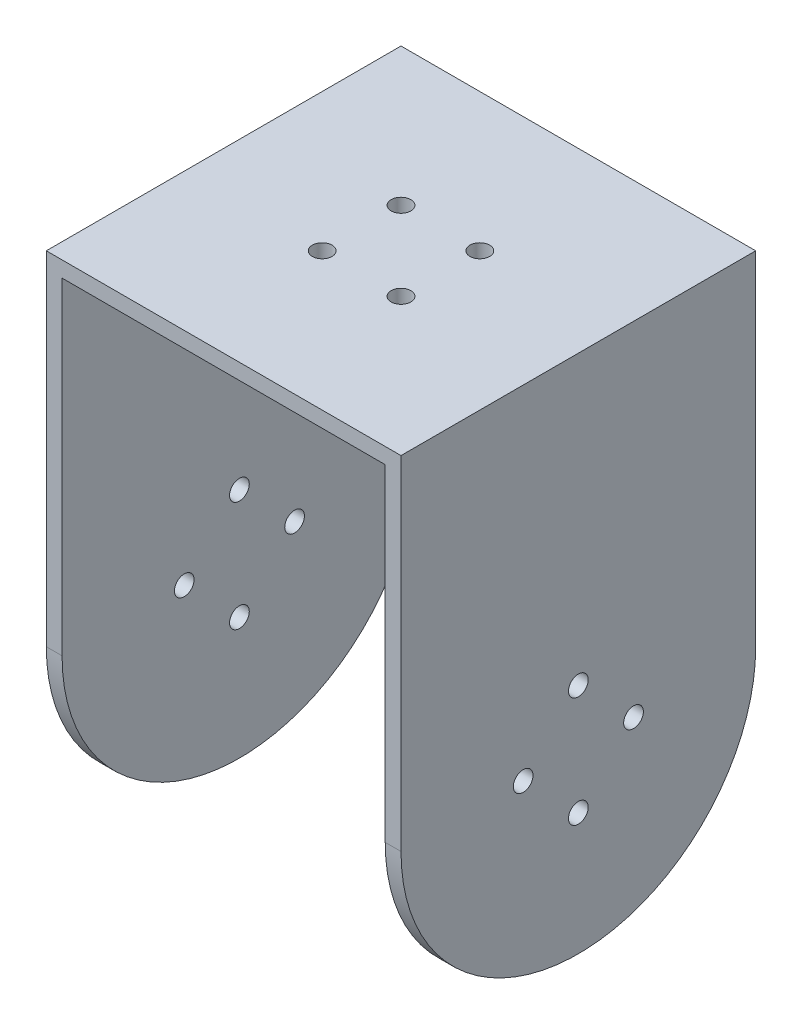
ISO-10303-21;
HEADER;
FILE_DESCRIPTION(('STEP AP214'),'2;1');
FILE_NAME('part.step','',(''),(''),'','','');
FILE_SCHEMA(('AUTOMOTIVE_DESIGN { 1 0 10303 214 1 1 1 1 }'));
ENDSEC;
DATA;
#1=APPLICATION_CONTEXT('core data for automotive mechanical design processes');
#2=APPLICATION_PROTOCOL_DEFINITION('international standard','automotive_design',2000,#1);
#3=PRODUCT_CONTEXT('',#1,'mechanical');
#4=PRODUCT('Part','Part','',(#3));
#5=PRODUCT_RELATED_PRODUCT_CATEGORY('part','',(#4));
#6=PRODUCT_DEFINITION_FORMATION('','',#4);
#7=PRODUCT_DEFINITION_CONTEXT('part definition',#1,'design');
#8=PRODUCT_DEFINITION('design','',#6,#7);
#9=PRODUCT_DEFINITION_SHAPE('','',#8);
#10=(LENGTH_UNIT() NAMED_UNIT(*) SI_UNIT(.MILLI.,.METRE.));
#11=(NAMED_UNIT(*) PLANE_ANGLE_UNIT() SI_UNIT($,.RADIAN.));
#12=(NAMED_UNIT(*) SI_UNIT($,.STERADIAN.) SOLID_ANGLE_UNIT());
#13=UNCERTAINTY_MEASURE_WITH_UNIT(LENGTH_MEASURE(1.E-05),#10,'distance_accuracy_value','');
#14=(GEOMETRIC_REPRESENTATION_CONTEXT(3) GLOBAL_UNCERTAINTY_ASSIGNED_CONTEXT((#13)) GLOBAL_UNIT_ASSIGNED_CONTEXT((#10,
#11,#12)) REPRESENTATION_CONTEXT('',''));
#15=CARTESIAN_POINT('',(0.,0.,0.));
#16=DIRECTION('',(0.,0.,1.));
#17=DIRECTION('',(1.,0.,0.));
#18=AXIS2_PLACEMENT_3D('',#15,#16,#17);
#19=CARTESIAN_POINT('',(-22.5,0.,0.));
#20=DIRECTION('',(1.,0.,0.));
#21=DIRECTION('',(0.,0.,-1.));
#22=AXIS2_PLACEMENT_3D('',#19,#20,#21);
#23=CYLINDRICAL_SURFACE('',#22,22.5);
#24=DIRECTION('',(1.,0.,0.));
#25=VECTOR('',#24,1.);
#26=CARTESIAN_POINT('',(-22.5,0.,22.5));
#27=LINE('',#26,#25);
#28=CARTESIAN_POINT('',(20.5,0.,22.5));
#29=VERTEX_POINT('',#28);
#30=CARTESIAN_POINT('',(22.5,0.,22.5));
#31=VERTEX_POINT('',#30);
#32=EDGE_CURVE('E42',#29,#31,#27,.T.);
#33=ORIENTED_EDGE('',*,*,#32,.F.);
#34=CARTESIAN_POINT('',(20.5,0.,0.));
#35=DIRECTION('',(-1.,0.,0.));
#36=DIRECTION('',(0.,0.,1.));
#37=AXIS2_PLACEMENT_3D('',#34,#35,#36);
#38=CIRCLE('',#37,22.5);
#39=CARTESIAN_POINT('',(20.5,0.,-22.5));
#40=VERTEX_POINT('',#39);
#41=EDGE_CURVE('E122',#29,#40,#38,.F.);
#42=ORIENTED_EDGE('',*,*,#41,.T.);
#43=DIRECTION('',(1.,0.,0.));
#44=VECTOR('',#43,1.);
#45=CARTESIAN_POINT('',(-22.5,0.,-22.5));
#46=LINE('',#45,#44);
#47=CARTESIAN_POINT('',(22.5,0.,-22.5));
#48=VERTEX_POINT('',#47);
#49=EDGE_CURVE('E118',#40,#48,#46,.T.);
#50=ORIENTED_EDGE('',*,*,#49,.T.);
#51=CARTESIAN_POINT('',(22.5,0.,0.));
#52=DIRECTION('',(1.,0.,0.));
#53=DIRECTION('',(0.,0.,1.));
#54=AXIS2_PLACEMENT_3D('',#51,#52,#53);
#55=CIRCLE('',#54,22.5);
#56=EDGE_CURVE('E129',#31,#48,#55,.T.);
#57=ORIENTED_EDGE('',*,*,#56,.F.);
#58=EDGE_LOOP('',(#33,#42,#50,#57));
#59=FACE_BOUND('',#58,.T.);
#60=ADVANCED_FACE('F34',(#59),#23,.T.);
#61=CARTESIAN_POINT('',(-22.5,0.,-22.5));
#62=VERTEX_POINT('',#61);
#63=CARTESIAN_POINT('',(-20.5,0.,-22.5));
#64=VERTEX_POINT('',#63);
#65=EDGE_CURVE('E156',#62,#64,#46,.T.);
#66=ORIENTED_EDGE('',*,*,#65,.T.);
#67=CARTESIAN_POINT('',(-20.5,0.,0.));
#68=DIRECTION('',(1.,0.,0.));
#69=DIRECTION('',(0.,0.,-1.));
#70=AXIS2_PLACEMENT_3D('',#67,#68,#69);
#71=CIRCLE('',#70,22.5);
#72=CARTESIAN_POINT('',(-20.5,0.,22.5));
#73=VERTEX_POINT('',#72);
#74=EDGE_CURVE('E119',#64,#73,#71,.F.);
#75=ORIENTED_EDGE('',*,*,#74,.T.);
#76=CARTESIAN_POINT('',(-22.5,0.,22.5));
#77=VERTEX_POINT('',#76);
#78=EDGE_CURVE('E11',#77,#73,#27,.T.);
#79=ORIENTED_EDGE('',*,*,#78,.F.);
#80=CARTESIAN_POINT('',(-22.5,0.,0.));
#81=DIRECTION('',(1.,0.,0.));
#82=DIRECTION('',(0.,0.,1.));
#83=AXIS2_PLACEMENT_3D('',#80,#81,#82);
#84=CIRCLE('',#83,22.5);
#85=EDGE_CURVE('E141',#77,#62,#84,.T.);
#86=ORIENTED_EDGE('',*,*,#85,.T.);
#87=EDGE_LOOP('',(#66,#75,#79,#86));
#88=FACE_BOUND('',#87,.T.);
#89=ADVANCED_FACE('F231',(#88),#23,.T.);
#90=CARTESIAN_POINT('',(-22.5,0.,22.5));
#91=DIRECTION('',(0.,0.,1.));
#92=DIRECTION('',(1.,0.,0.));
#93=AXIS2_PLACEMENT_3D('',#90,#91,#92);
#94=PLANE('',#93);
#95=DIRECTION('',(1.,0.,0.));
#96=VECTOR('',#95,1.);
#97=CARTESIAN_POINT('',(-20.5,41.5,22.5));
#98=LINE('',#97,#96);
#99=CARTESIAN_POINT('',(-20.5,41.5,22.5));
#100=VERTEX_POINT('',#99);
#101=CARTESIAN_POINT('',(20.5,41.5,22.5));
#102=VERTEX_POINT('',#101);
#103=EDGE_CURVE('E217',#100,#102,#98,.T.);
#104=ORIENTED_EDGE('',*,*,#103,.T.);
#105=DIRECTION('',(0.,-1.,0.));
#106=VECTOR('',#105,1.);
#107=CARTESIAN_POINT('',(20.5,41.5,22.5));
#108=LINE('',#107,#106);
#109=EDGE_CURVE('E113',#102,#29,#108,.T.);
#110=ORIENTED_EDGE('',*,*,#109,.T.);
#111=ORIENTED_EDGE('',*,*,#32,.T.);
#112=DIRECTION('',(0.,-1.,0.));
#113=VECTOR('',#112,1.);
#114=CARTESIAN_POINT('',(22.5,0.,22.5));
#115=LINE('',#114,#113);
#116=CARTESIAN_POINT('',(22.5,43.5,22.5));
#117=VERTEX_POINT('',#116);
#118=EDGE_CURVE('E138',#117,#31,#115,.T.);
#119=ORIENTED_EDGE('',*,*,#118,.F.);
#120=DIRECTION('',(1.,0.,0.));
#121=VECTOR('',#120,1.);
#122=CARTESIAN_POINT('',(-22.5,43.5,22.5));
#123=LINE('',#122,#121);
#124=CARTESIAN_POINT('',(-22.5,43.5,22.5));
#125=VERTEX_POINT('',#124);
#126=EDGE_CURVE('E152',#125,#117,#123,.T.);
#127=ORIENTED_EDGE('',*,*,#126,.F.);
#128=DIRECTION('',(0.,-1.,0.));
#129=VECTOR('',#128,1.);
#130=CARTESIAN_POINT('',(-22.5,0.,22.5));
#131=LINE('',#130,#129);
#132=EDGE_CURVE('E149',#125,#77,#131,.T.);
#133=ORIENTED_EDGE('',*,*,#132,.T.);
#134=ORIENTED_EDGE('',*,*,#78,.T.);
#135=DIRECTION('',(0.,-1.,0.));
#136=VECTOR('',#135,1.);
#137=CARTESIAN_POINT('',(-20.5,41.5,22.5));
#138=LINE('',#137,#136);
#139=EDGE_CURVE('E124',#100,#73,#138,.T.);
#140=ORIENTED_EDGE('',*,*,#139,.F.);
#141=EDGE_LOOP('',(#104,#110,#111,#119,#127,#133,#134,#140));
#142=FACE_BOUND('',#141,.T.);
#143=ADVANCED_FACE('F224',(#142),#94,.T.);
#144=CARTESIAN_POINT('',(-22.5,0.,-22.5));
#145=DIRECTION('',(0.,0.,-1.));
#146=DIRECTION('',(-1.,0.,0.));
#147=AXIS2_PLACEMENT_3D('',#144,#145,#146);
#148=PLANE('',#147);
#149=ORIENTED_EDGE('',*,*,#49,.F.);
#150=DIRECTION('',(0.,-1.,0.));
#151=VECTOR('',#150,1.);
#152=CARTESIAN_POINT('',(20.5,41.5,-22.5));
#153=LINE('',#152,#151);
#154=CARTESIAN_POINT('',(20.5,41.5,-22.5));
#155=VERTEX_POINT('',#154);
#156=EDGE_CURVE('E110',#155,#40,#153,.T.);
#157=ORIENTED_EDGE('',*,*,#156,.F.);
#158=DIRECTION('',(-1.,0.,0.));
#159=VECTOR('',#158,1.);
#160=CARTESIAN_POINT('',(-20.5,41.5,-22.5));
#161=LINE('',#160,#159);
#162=CARTESIAN_POINT('',(-20.5,41.5,-22.5));
#163=VERTEX_POINT('',#162);
#164=EDGE_CURVE('E98',#155,#163,#161,.T.);
#165=ORIENTED_EDGE('',*,*,#164,.T.);
#166=DIRECTION('',(0.,-1.,0.));
#167=VECTOR('',#166,1.);
#168=CARTESIAN_POINT('',(-20.5,41.5,-22.5));
#169=LINE('',#168,#167);
#170=EDGE_CURVE('E120',#163,#64,#169,.T.);
#171=ORIENTED_EDGE('',*,*,#170,.T.);
#172=ORIENTED_EDGE('',*,*,#65,.F.);
#173=DIRECTION('',(0.,1.,0.));
#174=VECTOR('',#173,1.);
#175=CARTESIAN_POINT('',(-22.5,0.,-22.5));
#176=LINE('',#175,#174);
#177=CARTESIAN_POINT('',(-22.5,43.5,-22.5));
#178=VERTEX_POINT('',#177);
#179=EDGE_CURVE('E143',#62,#178,#176,.T.);
#180=ORIENTED_EDGE('',*,*,#179,.T.);
#181=DIRECTION('',(1.,0.,0.));
#182=VECTOR('',#181,1.);
#183=CARTESIAN_POINT('',(-22.5,43.5,-22.5));
#184=LINE('',#183,#182);
#185=CARTESIAN_POINT('',(22.5,43.5,-22.5));
#186=VERTEX_POINT('',#185);
#187=EDGE_CURVE('E154',#178,#186,#184,.T.);
#188=ORIENTED_EDGE('',*,*,#187,.T.);
#189=DIRECTION('',(0.,1.,0.));
#190=VECTOR('',#189,1.);
#191=CARTESIAN_POINT('',(22.5,0.,-22.5));
#192=LINE('',#191,#190);
#193=EDGE_CURVE('E132',#48,#186,#192,.T.);
#194=ORIENTED_EDGE('',*,*,#193,.F.);
#195=EDGE_LOOP('',(#149,#157,#165,#171,#172,#180,#188,#194));
#196=FACE_BOUND('',#195,.T.);
#197=ADVANCED_FACE('F116',(#196),#148,.T.);
#198=CARTESIAN_POINT('',(-22.5,43.5,22.5));
#199=DIRECTION('',(0.,1.,0.));
#200=DIRECTION('',(0.,0.,1.));
#201=AXIS2_PLACEMENT_3D('',#198,#199,#200);
#202=PLANE('',#201);
#203=CARTESIAN_POINT('',(-5.,43.5,5.));
#204=DIRECTION('',(0.,1.,0.));
#205=DIRECTION('',(0.,0.,-1.));
#206=AXIS2_PLACEMENT_3D('',#203,#204,#205);
#207=CIRCLE('',#206,1.25);
#208=CARTESIAN_POINT('',(-5.,43.5,3.75));
#209=VERTEX_POINT('',#208);
#210=EDGE_CURVE('E205',#209,#209,#207,.T.);
#211=ORIENTED_EDGE('',*,*,#210,.F.);
#212=EDGE_LOOP('',(#211));
#213=FACE_BOUND('',#212,.T.);
#214=CARTESIAN_POINT('',(5.,43.5,-5.));
#215=DIRECTION('',(0.,1.,0.));
#216=DIRECTION('',(0.,0.,1.));
#217=AXIS2_PLACEMENT_3D('',#214,#215,#216);
#218=CIRCLE('',#217,1.25);
#219=CARTESIAN_POINT('',(5.,43.5,-3.75));
#220=VERTEX_POINT('',#219);
#221=EDGE_CURVE('E209',#220,#220,#218,.T.);
#222=ORIENTED_EDGE('',*,*,#221,.F.);
#223=EDGE_LOOP('',(#222));
#224=FACE_BOUND('',#223,.T.);
#225=CARTESIAN_POINT('',(5.,43.5,5.));
#226=DIRECTION('',(0.,1.,0.));
#227=DIRECTION('',(0.,0.,-1.));
#228=AXIS2_PLACEMENT_3D('',#225,#226,#227);
#229=CIRCLE('',#228,1.25);
#230=CARTESIAN_POINT('',(5.,43.5,3.75));
#231=VERTEX_POINT('',#230);
#232=EDGE_CURVE('E206',#231,#231,#229,.T.);
#233=ORIENTED_EDGE('',*,*,#232,.F.);
#234=EDGE_LOOP('',(#233));
#235=FACE_BOUND('',#234,.T.);
#236=CARTESIAN_POINT('',(-5.,43.5,-5.));
#237=DIRECTION('',(0.,1.,0.));
#238=DIRECTION('',(0.,0.,1.));
#239=AXIS2_PLACEMENT_3D('',#236,#237,#238);
#240=CIRCLE('',#239,1.25);
#241=CARTESIAN_POINT('',(-5.,43.5,-3.75));
#242=VERTEX_POINT('',#241);
#243=EDGE_CURVE('E163',#242,#242,#240,.T.);
#244=ORIENTED_EDGE('',*,*,#243,.F.);
#245=EDGE_LOOP('',(#244));
#246=FACE_BOUND('',#245,.T.);
#247=ORIENTED_EDGE('',*,*,#126,.T.);
#248=DIRECTION('',(0.,0.,1.));
#249=VECTOR('',#248,1.);
#250=CARTESIAN_POINT('',(22.5,43.5,22.5));
#251=LINE('',#250,#249);
#252=EDGE_CURVE('E135',#186,#117,#251,.T.);
#253=ORIENTED_EDGE('',*,*,#252,.F.);
#254=ORIENTED_EDGE('',*,*,#187,.F.);
#255=DIRECTION('',(0.,0.,1.));
#256=VECTOR('',#255,1.);
#257=CARTESIAN_POINT('',(-22.5,43.5,22.5));
#258=LINE('',#257,#256);
#259=EDGE_CURVE('E146',#178,#125,#258,.T.);
#260=ORIENTED_EDGE('',*,*,#259,.T.);
#261=EDGE_LOOP('',(#247,#253,#254,#260));
#262=FACE_BOUND('',#261,.T.);
#263=ADVANCED_FACE('F237',(#213,#224,#235,#246,#262),#202,.T.);
#264=CARTESIAN_POINT('',(-22.5,0.,0.));
#265=DIRECTION('',(-1.,0.,0.));
#266=DIRECTION('',(0.,0.,1.));
#267=AXIS2_PLACEMENT_3D('',#264,#265,#266);
#268=PLANE('',#267);
#269=CARTESIAN_POINT('',(-22.5,0.,0.));
#270=DIRECTION('',(-1.,0.,0.));
#271=DIRECTION('',(0.,0.,1.));
#272=AXIS2_PLACEMENT_3D('',#269,#270,#271);
#273=CIRCLE('',#272,3.18176817692474);
#274=CARTESIAN_POINT('',(-22.5,0.,3.18176817692474));
#275=VERTEX_POINT('',#274);
#276=EDGE_CURVE('E323',#275,#275,#273,.T.);
#277=ORIENTED_EDGE('',*,*,#276,.F.);
#278=EDGE_LOOP('',(#277));
#279=FACE_BOUND('',#278,.T.);
#280=CARTESIAN_POINT('',(-22.5,7.,0.));
#281=DIRECTION('',(-1.,0.,0.));
#282=DIRECTION('',(0.,0.,1.));
#283=AXIS2_PLACEMENT_3D('',#280,#281,#282);
#284=CIRCLE('',#283,1.25);
#285=CARTESIAN_POINT('',(-22.5,7.,1.25));
#286=VERTEX_POINT('',#285);
#287=EDGE_CURVE('E175',#286,#286,#284,.T.);
#288=ORIENTED_EDGE('',*,*,#287,.F.);
#289=EDGE_LOOP('',(#288));
#290=FACE_BOUND('',#289,.T.);
#291=CARTESIAN_POINT('',(-22.5,-7.,0.));
#292=DIRECTION('',(-1.,0.,0.));
#293=DIRECTION('',(0.,0.,-1.));
#294=AXIS2_PLACEMENT_3D('',#291,#292,#293);
#295=CIRCLE('',#294,1.25);
#296=CARTESIAN_POINT('',(-22.5,-7.,-1.25));
#297=VERTEX_POINT('',#296);
#298=EDGE_CURVE('E333',#297,#297,#295,.T.);
#299=ORIENTED_EDGE('',*,*,#298,.F.);
#300=EDGE_LOOP('',(#299));
#301=FACE_BOUND('',#300,.T.);
#302=CARTESIAN_POINT('',(-22.5,0.,-7.));
#303=DIRECTION('',(-1.,0.,0.));
#304=DIRECTION('',(0.,0.,1.));
#305=AXIS2_PLACEMENT_3D('',#302,#303,#304);
#306=CIRCLE('',#305,1.25);
#307=CARTESIAN_POINT('',(-22.5,0.,-5.75));
#308=VERTEX_POINT('',#307);
#309=EDGE_CURVE('E326',#308,#308,#306,.T.);
#310=ORIENTED_EDGE('',*,*,#309,.F.);
#311=EDGE_LOOP('',(#310));
#312=FACE_BOUND('',#311,.T.);
#313=CARTESIAN_POINT('',(-22.5,0.,7.));
#314=DIRECTION('',(-1.,0.,0.));
#315=DIRECTION('',(0.,0.,-1.));
#316=AXIS2_PLACEMENT_3D('',#313,#314,#315);
#317=CIRCLE('',#316,1.25);
#318=CARTESIAN_POINT('',(-22.5,0.,5.75));
#319=VERTEX_POINT('',#318);
#320=EDGE_CURVE('E322',#319,#319,#317,.T.);
#321=ORIENTED_EDGE('',*,*,#320,.F.);
#322=EDGE_LOOP('',(#321));
#323=FACE_BOUND('',#322,.T.);
#324=ORIENTED_EDGE('',*,*,#85,.F.);
#325=ORIENTED_EDGE('',*,*,#132,.F.);
#326=ORIENTED_EDGE('',*,*,#259,.F.);
#327=ORIENTED_EDGE('',*,*,#179,.F.);
#328=EDGE_LOOP('',(#324,#325,#326,#327));
#329=FACE_BOUND('',#328,.T.);
#330=ADVANCED_FACE('F229',(#279,#290,#301,#312,#323,#329),#268,.T.);
#331=CARTESIAN_POINT('',(22.5,0.,0.));
#332=DIRECTION('',(-1.,0.,0.));
#333=DIRECTION('',(0.,0.,1.));
#334=AXIS2_PLACEMENT_3D('',#331,#332,#333);
#335=PLANE('',#334);
#336=CARTESIAN_POINT('',(22.5,7.,0.));
#337=DIRECTION('',(-1.,0.,0.));
#338=DIRECTION('',(0.,0.,1.));
#339=AXIS2_PLACEMENT_3D('',#336,#337,#338);
#340=CIRCLE('',#339,1.25);
#341=CARTESIAN_POINT('',(22.5,7.,1.25));
#342=VERTEX_POINT('',#341);
#343=EDGE_CURVE('E202',#342,#342,#340,.T.);
#344=ORIENTED_EDGE('',*,*,#343,.T.);
#345=EDGE_LOOP('',(#344));
#346=FACE_BOUND('',#345,.T.);
#347=CARTESIAN_POINT('',(22.5,-7.,0.));
#348=DIRECTION('',(-1.,0.,0.));
#349=DIRECTION('',(0.,0.,1.));
#350=AXIS2_PLACEMENT_3D('',#347,#348,#349);
#351=CIRCLE('',#350,1.25);
#352=CARTESIAN_POINT('',(22.5,-7.,1.25));
#353=VERTEX_POINT('',#352);
#354=EDGE_CURVE('E187',#353,#353,#351,.T.);
#355=ORIENTED_EDGE('',*,*,#354,.T.);
#356=EDGE_LOOP('',(#355));
#357=FACE_BOUND('',#356,.T.);
#358=CARTESIAN_POINT('',(22.5,0.,-7.));
#359=DIRECTION('',(-1.,0.,0.));
#360=DIRECTION('',(0.,0.,1.));
#361=AXIS2_PLACEMENT_3D('',#358,#359,#360);
#362=CIRCLE('',#361,1.25);
#363=CARTESIAN_POINT('',(22.5,0.,-5.75));
#364=VERTEX_POINT('',#363);
#365=EDGE_CURVE('E183',#364,#364,#362,.T.);
#366=ORIENTED_EDGE('',*,*,#365,.T.);
#367=EDGE_LOOP('',(#366));
#368=FACE_BOUND('',#367,.T.);
#369=CARTESIAN_POINT('',(22.5,0.,7.));
#370=DIRECTION('',(-1.,0.,0.));
#371=DIRECTION('',(0.,0.,1.));
#372=AXIS2_PLACEMENT_3D('',#369,#370,#371);
#373=CIRCLE('',#372,1.25);
#374=CARTESIAN_POINT('',(22.5,0.,8.25));
#375=VERTEX_POINT('',#374);
#376=EDGE_CURVE('E179',#375,#375,#373,.T.);
#377=ORIENTED_EDGE('',*,*,#376,.T.);
#378=EDGE_LOOP('',(#377));
#379=FACE_BOUND('',#378,.T.);
#380=ORIENTED_EDGE('',*,*,#56,.T.);
#381=ORIENTED_EDGE('',*,*,#193,.T.);
#382=ORIENTED_EDGE('',*,*,#252,.T.);
#383=ORIENTED_EDGE('',*,*,#118,.T.);
#384=EDGE_LOOP('',(#380,#381,#382,#383));
#385=FACE_BOUND('',#384,.T.);
#386=ADVANCED_FACE('F235',(#346,#357,#368,#379,#385),#335,.F.);
#387=CARTESIAN_POINT('',(20.5,41.5,-22.5));
#388=DIRECTION('',(-1.,0.,0.));
#389=DIRECTION('',(0.,0.,1.));
#390=AXIS2_PLACEMENT_3D('',#387,#388,#389);
#391=PLANE('',#390);
#392=CARTESIAN_POINT('',(20.5,7.,0.));
#393=DIRECTION('',(-1.,0.,0.));
#394=DIRECTION('',(0.,0.,1.));
#395=AXIS2_PLACEMENT_3D('',#392,#393,#394);
#396=CIRCLE('',#395,1.25);
#397=CARTESIAN_POINT('',(20.5,7.,1.25));
#398=VERTEX_POINT('',#397);
#399=EDGE_CURVE('E199',#398,#398,#396,.T.);
#400=ORIENTED_EDGE('',*,*,#399,.F.);
#401=EDGE_LOOP('',(#400));
#402=FACE_BOUND('',#401,.T.);
#403=CARTESIAN_POINT('',(20.5,-7.,0.));
#404=DIRECTION('',(-1.,0.,0.));
#405=DIRECTION('',(0.,0.,1.));
#406=AXIS2_PLACEMENT_3D('',#403,#404,#405);
#407=CIRCLE('',#406,1.25);
#408=CARTESIAN_POINT('',(20.5,-7.,1.25));
#409=VERTEX_POINT('',#408);
#410=EDGE_CURVE('E182',#409,#409,#407,.T.);
#411=ORIENTED_EDGE('',*,*,#410,.F.);
#412=EDGE_LOOP('',(#411));
#413=FACE_BOUND('',#412,.T.);
#414=CARTESIAN_POINT('',(20.5,0.,-7.));
#415=DIRECTION('',(-1.,0.,0.));
#416=DIRECTION('',(0.,0.,1.));
#417=AXIS2_PLACEMENT_3D('',#414,#415,#416);
#418=CIRCLE('',#417,1.25);
#419=CARTESIAN_POINT('',(20.5,0.,-5.75));
#420=VERTEX_POINT('',#419);
#421=EDGE_CURVE('E178',#420,#420,#418,.T.);
#422=ORIENTED_EDGE('',*,*,#421,.F.);
#423=EDGE_LOOP('',(#422));
#424=FACE_BOUND('',#423,.T.);
#425=CARTESIAN_POINT('',(20.5,0.,7.));
#426=DIRECTION('',(-1.,0.,0.));
#427=DIRECTION('',(0.,0.,1.));
#428=AXIS2_PLACEMENT_3D('',#425,#426,#427);
#429=CIRCLE('',#428,1.25);
#430=CARTESIAN_POINT('',(20.5,0.,8.25));
#431=VERTEX_POINT('',#430);
#432=EDGE_CURVE('E174',#431,#431,#429,.T.);
#433=ORIENTED_EDGE('',*,*,#432,.F.);
#434=EDGE_LOOP('',(#433));
#435=FACE_BOUND('',#434,.T.);
#436=ORIENTED_EDGE('',*,*,#109,.F.);
#437=DIRECTION('',(0.,0.,-1.));
#438=VECTOR('',#437,1.);
#439=CARTESIAN_POINT('',(20.5,41.5,-22.5));
#440=LINE('',#439,#438);
#441=EDGE_CURVE('E101',#102,#155,#440,.T.);
#442=ORIENTED_EDGE('',*,*,#441,.T.);
#443=ORIENTED_EDGE('',*,*,#156,.T.);
#444=ORIENTED_EDGE('',*,*,#41,.F.);
#445=EDGE_LOOP('',(#436,#442,#443,#444));
#446=FACE_BOUND('',#445,.T.);
#447=ADVANCED_FACE('F109',(#402,#413,#424,#435,#446),#391,.T.);
#448=CARTESIAN_POINT('',(-20.5,41.5,-22.5));
#449=DIRECTION('',(1.,0.,0.));
#450=DIRECTION('',(0.,0.,-1.));
#451=AXIS2_PLACEMENT_3D('',#448,#449,#450);
#452=PLANE('',#451);
#453=CARTESIAN_POINT('',(-20.5,7.,0.));
#454=DIRECTION('',(1.,0.,0.));
#455=DIRECTION('',(0.,0.,-1.));
#456=AXIS2_PLACEMENT_3D('',#453,#454,#455);
#457=CIRCLE('',#456,1.25);
#458=CARTESIAN_POINT('',(-20.5,7.,-1.25));
#459=VERTEX_POINT('',#458);
#460=EDGE_CURVE('E37',#459,#459,#457,.T.);
#461=ORIENTED_EDGE('',*,*,#460,.F.);
#462=EDGE_LOOP('',(#461));
#463=FACE_BOUND('',#462,.T.);
#464=CARTESIAN_POINT('',(-20.5,-7.,0.));
#465=DIRECTION('',(1.,0.,0.));
#466=DIRECTION('',(0.,0.,-1.));
#467=AXIS2_PLACEMENT_3D('',#464,#465,#466);
#468=CIRCLE('',#467,1.25);
#469=CARTESIAN_POINT('',(-20.5,-7.,-1.25));
#470=VERTEX_POINT('',#469);
#471=EDGE_CURVE('E180',#470,#470,#468,.T.);
#472=ORIENTED_EDGE('',*,*,#471,.F.);
#473=EDGE_LOOP('',(#472));
#474=FACE_BOUND('',#473,.T.);
#475=CARTESIAN_POINT('',(-20.5,0.,-7.));
#476=DIRECTION('',(1.,0.,0.));
#477=DIRECTION('',(0.,0.,-1.));
#478=AXIS2_PLACEMENT_3D('',#475,#476,#477);
#479=CIRCLE('',#478,1.25);
#480=CARTESIAN_POINT('',(-20.5,0.,-8.25));
#481=VERTEX_POINT('',#480);
#482=EDGE_CURVE('E176',#481,#481,#479,.T.);
#483=ORIENTED_EDGE('',*,*,#482,.F.);
#484=EDGE_LOOP('',(#483));
#485=FACE_BOUND('',#484,.T.);
#486=CARTESIAN_POINT('',(-20.5,0.,7.));
#487=DIRECTION('',(1.,0.,0.));
#488=DIRECTION('',(0.,0.,-1.));
#489=AXIS2_PLACEMENT_3D('',#486,#487,#488);
#490=CIRCLE('',#489,1.25);
#491=CARTESIAN_POINT('',(-20.5,0.,5.75));
#492=VERTEX_POINT('',#491);
#493=EDGE_CURVE('E171',#492,#492,#490,.T.);
#494=ORIENTED_EDGE('',*,*,#493,.F.);
#495=EDGE_LOOP('',(#494));
#496=FACE_BOUND('',#495,.T.);
#497=ORIENTED_EDGE('',*,*,#170,.F.);
#498=DIRECTION('',(0.,0.,1.));
#499=VECTOR('',#498,1.);
#500=CARTESIAN_POINT('',(-20.5,41.5,-22.5));
#501=LINE('',#500,#499);
#502=EDGE_CURVE('E50',#163,#100,#501,.T.);
#503=ORIENTED_EDGE('',*,*,#502,.T.);
#504=ORIENTED_EDGE('',*,*,#139,.T.);
#505=ORIENTED_EDGE('',*,*,#74,.F.);
#506=EDGE_LOOP('',(#497,#503,#504,#505));
#507=FACE_BOUND('',#506,.T.);
#508=ADVANCED_FACE('F222',(#463,#474,#485,#496,#507),#452,.T.);
#509=CARTESIAN_POINT('',(0.,41.5,0.));
#510=DIRECTION('',(0.,1.,0.));
#511=DIRECTION('',(0.,0.,1.));
#512=AXIS2_PLACEMENT_3D('',#509,#510,#511);
#513=PLANE('',#512);
#514=CARTESIAN_POINT('',(-5.,41.5,5.));
#515=DIRECTION('',(0.,1.,0.));
#516=DIRECTION('',(0.,0.,1.));
#517=AXIS2_PLACEMENT_3D('',#514,#515,#516);
#518=CIRCLE('',#517,1.25);
#519=CARTESIAN_POINT('',(-5.,41.5,6.25));
#520=VERTEX_POINT('',#519);
#521=EDGE_CURVE('E114',#520,#520,#518,.T.);
#522=ORIENTED_EDGE('',*,*,#521,.T.);
#523=EDGE_LOOP('',(#522));
#524=FACE_BOUND('',#523,.T.);
#525=CARTESIAN_POINT('',(5.,41.5,-5.));
#526=DIRECTION('',(0.,1.,0.));
#527=DIRECTION('',(0.,0.,1.));
#528=AXIS2_PLACEMENT_3D('',#525,#526,#527);
#529=CIRCLE('',#528,1.25);
#530=CARTESIAN_POINT('',(5.,41.5,-3.75));
#531=VERTEX_POINT('',#530);
#532=EDGE_CURVE('E166',#531,#531,#529,.T.);
#533=ORIENTED_EDGE('',*,*,#532,.T.);
#534=EDGE_LOOP('',(#533));
#535=FACE_BOUND('',#534,.T.);
#536=CARTESIAN_POINT('',(5.,41.5,5.));
#537=DIRECTION('',(0.,1.,0.));
#538=DIRECTION('',(0.,0.,1.));
#539=AXIS2_PLACEMENT_3D('',#536,#537,#538);
#540=CIRCLE('',#539,1.25);
#541=CARTESIAN_POINT('',(5.,41.5,6.25));
#542=VERTEX_POINT('',#541);
#543=EDGE_CURVE('E162',#542,#542,#540,.T.);
#544=ORIENTED_EDGE('',*,*,#543,.T.);
#545=EDGE_LOOP('',(#544));
#546=FACE_BOUND('',#545,.T.);
#547=CARTESIAN_POINT('',(-5.,41.5,-5.));
#548=DIRECTION('',(0.,1.,0.));
#549=DIRECTION('',(0.,0.,1.));
#550=AXIS2_PLACEMENT_3D('',#547,#548,#549);
#551=CIRCLE('',#550,1.25);
#552=CARTESIAN_POINT('',(-5.,41.5,-3.75));
#553=VERTEX_POINT('',#552);
#554=EDGE_CURVE('E159',#553,#553,#551,.T.);
#555=ORIENTED_EDGE('',*,*,#554,.T.);
#556=EDGE_LOOP('',(#555));
#557=FACE_BOUND('',#556,.T.);
#558=ORIENTED_EDGE('',*,*,#441,.F.);
#559=ORIENTED_EDGE('',*,*,#103,.F.);
#560=ORIENTED_EDGE('',*,*,#502,.F.);
#561=ORIENTED_EDGE('',*,*,#164,.F.);
#562=EDGE_LOOP('',(#558,#559,#560,#561));
#563=FACE_BOUND('',#562,.T.);
#564=ADVANCED_FACE('F100',(#524,#535,#546,#557,#563),#513,.F.);
#565=CARTESIAN_POINT('',(-5.,25.,-5.));
#566=DIRECTION('',(0.,1.,0.));
#567=DIRECTION('',(0.,0.,1.));
#568=AXIS2_PLACEMENT_3D('',#565,#566,#567);
#569=CYLINDRICAL_SURFACE('',#568,1.25);
#570=ORIENTED_EDGE('',*,*,#243,.T.);
#571=EDGE_LOOP('',(#570));
#572=FACE_BOUND('',#571,.T.);
#573=ORIENTED_EDGE('',*,*,#554,.F.);
#574=EDGE_LOOP('',(#573));
#575=FACE_BOUND('',#574,.T.);
#576=ADVANCED_FACE('F274',(#572,#575),#569,.F.);
#577=CARTESIAN_POINT('',(5.,25.,5.));
#578=DIRECTION('',(0.,1.,0.));
#579=DIRECTION('',(0.,0.,1.));
#580=AXIS2_PLACEMENT_3D('',#577,#578,#579);
#581=CYLINDRICAL_SURFACE('',#580,1.25);
#582=ORIENTED_EDGE('',*,*,#232,.T.);
#583=EDGE_LOOP('',(#582));
#584=FACE_BOUND('',#583,.T.);
#585=ORIENTED_EDGE('',*,*,#543,.F.);
#586=EDGE_LOOP('',(#585));
#587=FACE_BOUND('',#586,.T.);
#588=ADVANCED_FACE('F278',(#584,#587),#581,.F.);
#589=CARTESIAN_POINT('',(5.,25.,-5.));
#590=DIRECTION('',(0.,1.,0.));
#591=DIRECTION('',(0.,0.,1.));
#592=AXIS2_PLACEMENT_3D('',#589,#590,#591);
#593=CYLINDRICAL_SURFACE('',#592,1.25);
#594=ORIENTED_EDGE('',*,*,#221,.T.);
#595=EDGE_LOOP('',(#594));
#596=FACE_BOUND('',#595,.T.);
#597=ORIENTED_EDGE('',*,*,#532,.F.);
#598=EDGE_LOOP('',(#597));
#599=FACE_BOUND('',#598,.T.);
#600=ADVANCED_FACE('F284',(#596,#599),#593,.F.);
#601=CARTESIAN_POINT('',(-5.,25.,5.));
#602=DIRECTION('',(0.,1.,0.));
#603=DIRECTION('',(0.,0.,1.));
#604=AXIS2_PLACEMENT_3D('',#601,#602,#603);
#605=CYLINDRICAL_SURFACE('',#604,1.25);
#606=ORIENTED_EDGE('',*,*,#210,.T.);
#607=EDGE_LOOP('',(#606));
#608=FACE_BOUND('',#607,.T.);
#609=ORIENTED_EDGE('',*,*,#521,.F.);
#610=EDGE_LOOP('',(#609));
#611=FACE_BOUND('',#610,.T.);
#612=ADVANCED_FACE('F280',(#608,#611),#605,.F.);
#613=CARTESIAN_POINT('',(36.,0.,7.));
#614=DIRECTION('',(-1.,0.,0.));
#615=DIRECTION('',(0.,0.,1.));
#616=AXIS2_PLACEMENT_3D('',#613,#614,#615);
#617=CYLINDRICAL_SURFACE('',#616,1.25);
#618=ORIENTED_EDGE('',*,*,#493,.T.);
#619=EDGE_LOOP('',(#618));
#620=FACE_BOUND('',#619,.T.);
#621=ORIENTED_EDGE('',*,*,#320,.T.);
#622=EDGE_LOOP('',(#621));
#623=FACE_BOUND('',#622,.T.);
#624=ADVANCED_FACE('F283',(#620,#623),#617,.F.);
#625=CARTESIAN_POINT('',(36.,0.,-7.));
#626=DIRECTION('',(-1.,0.,0.));
#627=DIRECTION('',(0.,0.,1.));
#628=AXIS2_PLACEMENT_3D('',#625,#626,#627);
#629=CYLINDRICAL_SURFACE('',#628,1.25);
#630=ORIENTED_EDGE('',*,*,#482,.T.);
#631=EDGE_LOOP('',(#630));
#632=FACE_BOUND('',#631,.T.);
#633=ORIENTED_EDGE('',*,*,#309,.T.);
#634=EDGE_LOOP('',(#633));
#635=FACE_BOUND('',#634,.T.);
#636=ADVANCED_FACE('F294',(#632,#635),#629,.F.);
#637=CARTESIAN_POINT('',(36.,-7.,0.));
#638=DIRECTION('',(-1.,0.,0.));
#639=DIRECTION('',(0.,0.,1.));
#640=AXIS2_PLACEMENT_3D('',#637,#638,#639);
#641=CYLINDRICAL_SURFACE('',#640,1.25);
#642=ORIENTED_EDGE('',*,*,#471,.T.);
#643=EDGE_LOOP('',(#642));
#644=FACE_BOUND('',#643,.T.);
#645=ORIENTED_EDGE('',*,*,#298,.T.);
#646=EDGE_LOOP('',(#645));
#647=FACE_BOUND('',#646,.T.);
#648=ADVANCED_FACE('F299',(#644,#647),#641,.F.);
#649=CARTESIAN_POINT('',(36.,7.,0.));
#650=DIRECTION('',(-1.,0.,0.));
#651=DIRECTION('',(0.,0.,1.));
#652=AXIS2_PLACEMENT_3D('',#649,#650,#651);
#653=CYLINDRICAL_SURFACE('',#652,1.25);
#654=ORIENTED_EDGE('',*,*,#460,.T.);
#655=EDGE_LOOP('',(#654));
#656=FACE_BOUND('',#655,.T.);
#657=ORIENTED_EDGE('',*,*,#287,.T.);
#658=EDGE_LOOP('',(#657));
#659=FACE_BOUND('',#658,.T.);
#660=ADVANCED_FACE('F304',(#656,#659),#653,.F.);
#661=ORIENTED_EDGE('',*,*,#432,.T.);
#662=EDGE_LOOP('',(#661));
#663=FACE_BOUND('',#662,.T.);
#664=ORIENTED_EDGE('',*,*,#376,.F.);
#665=EDGE_LOOP('',(#664));
#666=FACE_BOUND('',#665,.T.);
#667=ADVANCED_FACE('F296',(#663,#666),#617,.F.);
#668=ORIENTED_EDGE('',*,*,#421,.T.);
#669=EDGE_LOOP('',(#668));
#670=FACE_BOUND('',#669,.T.);
#671=ORIENTED_EDGE('',*,*,#365,.F.);
#672=EDGE_LOOP('',(#671));
#673=FACE_BOUND('',#672,.T.);
#674=ADVANCED_FACE('F301',(#670,#673),#629,.F.);
#675=ORIENTED_EDGE('',*,*,#410,.T.);
#676=EDGE_LOOP('',(#675));
#677=FACE_BOUND('',#676,.T.);
#678=ORIENTED_EDGE('',*,*,#354,.F.);
#679=EDGE_LOOP('',(#678));
#680=FACE_BOUND('',#679,.T.);
#681=ADVANCED_FACE('F305',(#677,#680),#641,.F.);
#682=ORIENTED_EDGE('',*,*,#399,.T.);
#683=EDGE_LOOP('',(#682));
#684=FACE_BOUND('',#683,.T.);
#685=ORIENTED_EDGE('',*,*,#343,.F.);
#686=EDGE_LOOP('',(#685));
#687=FACE_BOUND('',#686,.T.);
#688=ADVANCED_FACE('F309',(#684,#687),#653,.F.);
#689=CARTESIAN_POINT('',(-21.5,0.,0.));
#690=DIRECTION('',(-1.,0.,0.));
#691=DIRECTION('',(0.,0.,1.));
#692=AXIS2_PLACEMENT_3D('',#689,#690,#691);
#693=CYLINDRICAL_SURFACE('',#692,3.18176817692474);
#694=CARTESIAN_POINT('',(-21.5,0.,0.));
#695=DIRECTION('',(-1.,0.,0.));
#696=DIRECTION('',(0.,0.,1.));
#697=AXIS2_PLACEMENT_3D('',#694,#695,#696);
#698=CIRCLE('',#697,3.18176817692474);
#699=CARTESIAN_POINT('',(-21.5,0.,3.18176817692474));
#700=VERTEX_POINT('',#699);
#701=EDGE_CURVE('E321',#700,#700,#698,.T.);
#702=ORIENTED_EDGE('',*,*,#701,.F.);
#703=EDGE_LOOP('',(#702));
#704=FACE_BOUND('',#703,.T.);
#705=ORIENTED_EDGE('',*,*,#276,.T.);
#706=EDGE_LOOP('',(#705));
#707=FACE_BOUND('',#706,.T.);
#708=ADVANCED_FACE('F310',(#704,#707),#693,.F.);
#709=CARTESIAN_POINT('',(-21.5,0.,0.));
#710=DIRECTION('',(-1.,0.,0.));
#711=DIRECTION('',(0.,0.,1.));
#712=AXIS2_PLACEMENT_3D('',#709,#710,#711);
#713=PLANE('',#712);
#714=ORIENTED_EDGE('',*,*,#701,.T.);
#715=EDGE_LOOP('',(#714));
#716=FACE_BOUND('',#715,.T.);
#717=ADVANCED_FACE('F313',(#716),#713,.T.);
#718=CLOSED_SHELL('',(#60,#89,#143,#197,#263,#330,#386,#447,#508,#564,#576,#588,#600,#612,#624,
#636,#648,#660,#667,#674,#681,#688,#708,#717));
#719=MANIFOLD_SOLID_BREP('B2',#718);
#720=ADVANCED_BREP_SHAPE_REPRESENTATION('',(#18,#719),#14);
#721=SHAPE_DEFINITION_REPRESENTATION(#9,#720);
ENDSEC;
END-ISO-10303-21;
